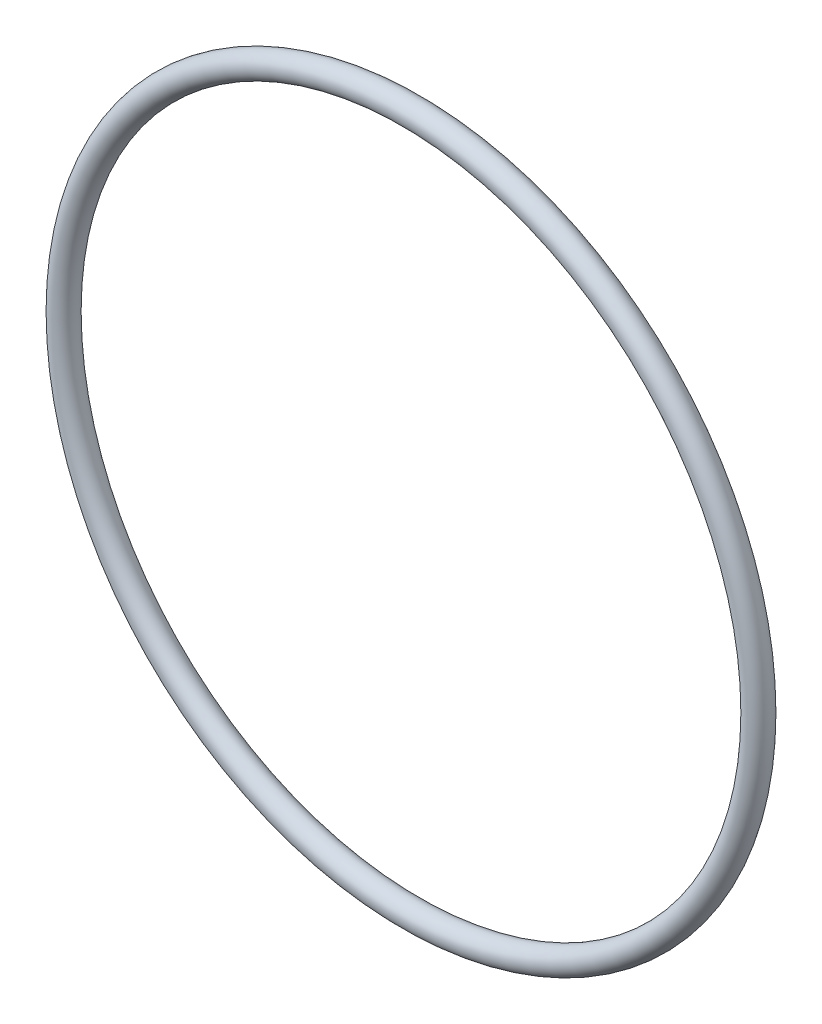
ISO-10303-21;
HEADER;
FILE_DESCRIPTION(('STEP AP214'),'2;1');
FILE_NAME('part.step','',(''),(''),'','','');
FILE_SCHEMA(('AUTOMOTIVE_DESIGN { 1 0 10303 214 1 1 1 1 }'));
ENDSEC;
DATA;
#1=APPLICATION_CONTEXT('core data for automotive mechanical design processes');
#2=APPLICATION_PROTOCOL_DEFINITION('international standard','automotive_design',2000,#1);
#3=PRODUCT_CONTEXT('',#1,'mechanical');
#4=PRODUCT('Part','Part','',(#3));
#5=PRODUCT_RELATED_PRODUCT_CATEGORY('part','',(#4));
#6=PRODUCT_DEFINITION_FORMATION('','',#4);
#7=PRODUCT_DEFINITION_CONTEXT('part definition',#1,'design');
#8=PRODUCT_DEFINITION('design','',#6,#7);
#9=PRODUCT_DEFINITION_SHAPE('','',#8);
#10=(LENGTH_UNIT() NAMED_UNIT(*) SI_UNIT(.MILLI.,.METRE.));
#11=(NAMED_UNIT(*) PLANE_ANGLE_UNIT() SI_UNIT($,.RADIAN.));
#12=(NAMED_UNIT(*) SI_UNIT($,.STERADIAN.) SOLID_ANGLE_UNIT());
#13=UNCERTAINTY_MEASURE_WITH_UNIT(LENGTH_MEASURE(1.E-05),#10,'distance_accuracy_value','');
#14=(GEOMETRIC_REPRESENTATION_CONTEXT(3) GLOBAL_UNCERTAINTY_ASSIGNED_CONTEXT((#13)) GLOBAL_UNIT_ASSIGNED_CONTEXT((#10,
#11,#12)) REPRESENTATION_CONTEXT('',''));
#15=CARTESIAN_POINT('',(0.,0.,0.));
#16=DIRECTION('',(0.,0.,1.));
#17=DIRECTION('',(1.,0.,0.));
#18=AXIS2_PLACEMENT_3D('',#15,#16,#17);
#19=CARTESIAN_POINT('',(0.,0.,1.));
#20=DIRECTION('',(0.,0.,-1.));
#21=DIRECTION('',(-1.,0.,0.));
#22=AXIS2_PLACEMENT_3D('',#19,#20,#21);
#23=TOROIDAL_SURFACE('',#22,1.4,0.0499999999999999);
#24=CARTESIAN_POINT('',(-1.45,0.,1.));
#25=VERTEX_POINT('',#24);
#26=VERTEX_LOOP('',#25);
#27=FACE_BOUND('',#26,.T.);
#28=ADVANCED_FACE('F13',(#27),#23,.T.);
#29=CLOSED_SHELL('',(#28));
#30=MANIFOLD_SOLID_BREP('B1',#29);
#31=ADVANCED_BREP_SHAPE_REPRESENTATION('',(#18,#30),#14);
#32=SHAPE_DEFINITION_REPRESENTATION(#9,#31);
ENDSEC;
END-ISO-10303-21;
